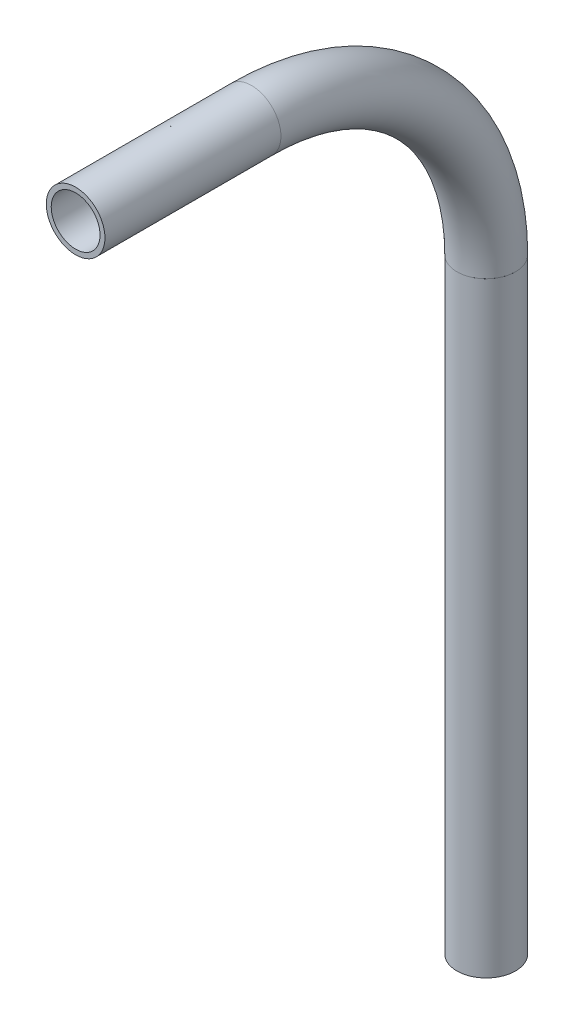
ISO-10303-21;
HEADER;
FILE_DESCRIPTION(('STEP AP214'),'2;1');
FILE_NAME('part.step','',(''),(''),'','','');
FILE_SCHEMA(('AUTOMOTIVE_DESIGN { 1 0 10303 214 1 1 1 1 }'));
ENDSEC;
DATA;
#1=APPLICATION_CONTEXT('core data for automotive mechanical design processes');
#2=APPLICATION_PROTOCOL_DEFINITION('international standard','automotive_design',2000,#1);
#3=PRODUCT_CONTEXT('',#1,'mechanical');
#4=PRODUCT('Part','Part','',(#3));
#5=PRODUCT_RELATED_PRODUCT_CATEGORY('part','',(#4));
#6=PRODUCT_DEFINITION_FORMATION('','',#4);
#7=PRODUCT_DEFINITION_CONTEXT('part definition',#1,'design');
#8=PRODUCT_DEFINITION('design','',#6,#7);
#9=PRODUCT_DEFINITION_SHAPE('','',#8);
#10=(LENGTH_UNIT() NAMED_UNIT(*) SI_UNIT(.MILLI.,.METRE.));
#11=(NAMED_UNIT(*) PLANE_ANGLE_UNIT() SI_UNIT($,.RADIAN.));
#12=(NAMED_UNIT(*) SI_UNIT($,.STERADIAN.) SOLID_ANGLE_UNIT());
#13=UNCERTAINTY_MEASURE_WITH_UNIT(LENGTH_MEASURE(1.E-05),#10,'distance_accuracy_value','');
#14=(GEOMETRIC_REPRESENTATION_CONTEXT(3) GLOBAL_UNCERTAINTY_ASSIGNED_CONTEXT((#13)) GLOBAL_UNIT_ASSIGNED_CONTEXT((#10,
#11,#12)) REPRESENTATION_CONTEXT('',''));
#15=CARTESIAN_POINT('',(0.,0.,0.));
#16=DIRECTION('',(0.,0.,1.));
#17=DIRECTION('',(1.,0.,0.));
#18=AXIS2_PLACEMENT_3D('',#15,#16,#17);
#19=CARTESIAN_POINT('',(0.,1154.01983603827,296.580509382977));
#20=DIRECTION('',(0.,-1.,0.));
#21=DIRECTION('',(0.,0.,-1.));
#22=AXIS2_PLACEMENT_3D('',#19,#20,#21);
#23=CYLINDRICAL_SURFACE('',#22,5.28319999999999);
#24=CARTESIAN_POINT('',(0.,1022.91902111895,296.580509382977));
#25=DIRECTION('',(0.,1.,0.));
#26=DIRECTION('',(0.,0.,1.));
#27=AXIS2_PLACEMENT_3D('',#24,#25,#26);
#28=CIRCLE('',#27,5.28319999999999);
#29=CARTESIAN_POINT('',(0.,1022.91902111895,301.863709382977));
#30=VERTEX_POINT('',#29);
#31=EDGE_CURVE('E50',#30,#30,#28,.T.);
#32=ORIENTED_EDGE('',*,*,#31,.F.);
#33=EDGE_LOOP('',(#32));
#34=FACE_BOUND('',#33,.T.);
#35=CARTESIAN_POINT('',(0.,1154.01983603827,296.580509382977));
#36=DIRECTION('',(0.,1.,0.));
#37=DIRECTION('',(0.,0.,1.));
#38=AXIS2_PLACEMENT_3D('',#35,#36,#37);
#39=CIRCLE('',#38,5.28319999999999);
#40=CARTESIAN_POINT('',(0.,1154.01983603827,301.863709382977));
#41=VERTEX_POINT('',#40);
#42=EDGE_CURVE('E46',#41,#41,#39,.T.);
#43=ORIENTED_EDGE('',*,*,#42,.T.);
#44=EDGE_LOOP('',(#43));
#45=FACE_BOUND('',#44,.T.);
#46=ADVANCED_FACE('F42',(#34,#45),#23,.F.);
#47=CARTESIAN_POINT('',(0.,1154.01983603827,296.580509382977));
#48=DIRECTION('',(0.,-1.,0.));
#49=DIRECTION('',(0.,0.,-1.));
#50=AXIS2_PLACEMENT_3D('',#47,#48,#49);
#51=CYLINDRICAL_SURFACE('',#50,6.35);
#52=CARTESIAN_POINT('',(0.,1022.91902111895,296.580509382977));
#53=DIRECTION('',(0.,1.,0.));
#54=DIRECTION('',(0.,0.,1.));
#55=AXIS2_PLACEMENT_3D('',#52,#53,#54);
#56=CIRCLE('',#55,6.35);
#57=CARTESIAN_POINT('',(0.,1022.91902111895,302.930509382977));
#58=VERTEX_POINT('',#57);
#59=EDGE_CURVE('E54',#58,#58,#56,.T.);
#60=ORIENTED_EDGE('',*,*,#59,.T.);
#61=EDGE_LOOP('',(#60));
#62=FACE_BOUND('',#61,.T.);
#63=CARTESIAN_POINT('',(0.,1154.01983603827,296.580509382977));
#64=DIRECTION('',(0.,1.,0.));
#65=DIRECTION('',(0.,0.,1.));
#66=AXIS2_PLACEMENT_3D('',#63,#64,#65);
#67=CIRCLE('',#66,6.35);
#68=CARTESIAN_POINT('',(0.,1154.01983603827,302.930509382977));
#69=VERTEX_POINT('',#68);
#70=EDGE_CURVE('E12',#69,#69,#67,.T.);
#71=ORIENTED_EDGE('',*,*,#70,.F.);
#72=EDGE_LOOP('',(#71));
#73=FACE_BOUND('',#72,.T.);
#74=ADVANCED_FACE('F69',(#62,#73),#51,.T.);
#75=CARTESIAN_POINT('',(0.,1022.91902111895,296.580509382977));
#76=DIRECTION('',(0.,1.,0.));
#77=DIRECTION('',(0.,0.,1.));
#78=AXIS2_PLACEMENT_3D('',#75,#76,#77);
#79=PLANE('',#78);
#80=ORIENTED_EDGE('',*,*,#31,.T.);
#81=EDGE_LOOP('',(#80));
#82=FACE_BOUND('',#81,.T.);
#83=ORIENTED_EDGE('',*,*,#59,.F.);
#84=EDGE_LOOP('',(#83));
#85=FACE_BOUND('',#84,.T.);
#86=ADVANCED_FACE('F65',(#82,#85),#79,.F.);
#87=CARTESIAN_POINT('',(0.,1154.01983603827,296.580509382977));
#88=DIRECTION('',(0.,1.,0.));
#89=DIRECTION('',(0.,0.,1.));
#90=AXIS2_PLACEMENT_3D('',#87,#88,#89);
#91=PLANE('',#90);
#92=ORIENTED_EDGE('',*,*,#42,.F.);
#93=EDGE_LOOP('',(#92));
#94=FACE_BOUND('',#93,.T.);
#95=ORIENTED_EDGE('',*,*,#70,.T.);
#96=EDGE_LOOP('',(#95));
#97=FACE_BOUND('',#96,.T.);
#98=ADVANCED_FACE('F44',(#94,#97),#91,.T.);
#99=CLOSED_SHELL('',(#46,#74,#86,#98));
#100=MANIFOLD_SOLID_BREP('B2',#99);
#101=CARTESIAN_POINT('',(0.,1154.01983603827,347.380509382977));
#102=DIRECTION('',(-1.,0.,0.));
#103=DIRECTION('',(0.,0.,1.));
#104=AXIS2_PLACEMENT_3D('',#101,#102,#103);
#105=TOROIDAL_SURFACE('',#104,50.7999999999997,5.28319999999999);
#106=CARTESIAN_POINT('',(0.,1204.81983603827,347.380509382977));
#107=DIRECTION('',(0.,0.,1.));
#108=DIRECTION('',(0.,-1.,0.));
#109=AXIS2_PLACEMENT_3D('',#106,#107,#108);
#110=CIRCLE('',#109,5.28319999999999);
#111=CARTESIAN_POINT('',(0.,1210.10303603827,347.380509382977));
#112=VERTEX_POINT('',#111);
#113=EDGE_CURVE('E135',#112,#112,#110,.T.);
#114=CARTESIAN_POINT('',(0.,1154.01983603827,296.580509382977));
#115=DIRECTION('',(0.,-1.,0.));
#116=DIRECTION('',(0.,0.,-1.));
#117=AXIS2_PLACEMENT_3D('',#114,#115,#116);
#118=CIRCLE('',#117,5.28319999999999);
#119=CARTESIAN_POINT('',(0.,1154.01983603827,291.297309382977));
#120=VERTEX_POINT('',#119);
#121=EDGE_CURVE('E125',#120,#120,#118,.T.);
#122=CARTESIAN_POINT('',(0.,1154.01983603827,347.380509382977));
#123=DIRECTION('',(-1.,0.,0.));
#124=DIRECTION('',(0.,0.,1.));
#125=AXIS2_PLACEMENT_3D('',#122,#123,#124);
#126=CIRCLE('',#125,56.0831999999997);
#127=EDGE_CURVE('',#112,#120,#126,.T.);
#128=ORIENTED_EDGE('',*,*,#113,.T.);
#129=ORIENTED_EDGE('',*,*,#121,.T.);
#130=ORIENTED_EDGE('',*,*,#127,.T.);
#131=ORIENTED_EDGE('',*,*,#127,.F.);
#132=EDGE_LOOP('',(#128,#130,#129,#131));
#133=FACE_BOUND('',#132,.T.);
#134=ADVANCED_FACE('F121',(#133),#105,.F.);
#135=CARTESIAN_POINT('',(0.,1154.01983603827,347.380509382977));
#136=DIRECTION('',(-1.,0.,0.));
#137=DIRECTION('',(0.,0.,1.));
#138=AXIS2_PLACEMENT_3D('',#135,#136,#137);
#139=TOROIDAL_SURFACE('',#138,50.7999999999997,6.35);
#140=CARTESIAN_POINT('',(0.,1204.81983603827,347.380509382977));
#141=DIRECTION('',(0.,0.,1.));
#142=DIRECTION('',(0.,-1.,0.));
#143=AXIS2_PLACEMENT_3D('',#140,#141,#142);
#144=CIRCLE('',#143,6.35);
#145=CARTESIAN_POINT('',(0.,1211.16983603827,347.380509382977));
#146=VERTEX_POINT('',#145);
#147=EDGE_CURVE('E129',#146,#146,#144,.T.);
#148=CARTESIAN_POINT('',(0.,1154.01983603827,296.580509382977));
#149=DIRECTION('',(0.,-1.,0.));
#150=DIRECTION('',(0.,0.,-1.));
#151=AXIS2_PLACEMENT_3D('',#148,#149,#150);
#152=CIRCLE('',#151,6.35);
#153=CARTESIAN_POINT('',(0.,1154.01983603827,290.230509382977));
#154=VERTEX_POINT('',#153);
#155=EDGE_CURVE('E41',#154,#154,#152,.T.);
#156=CARTESIAN_POINT('',(0.,1154.01983603827,347.380509382977));
#157=DIRECTION('',(-1.,0.,0.));
#158=DIRECTION('',(0.,0.,1.));
#159=AXIS2_PLACEMENT_3D('',#156,#157,#158);
#160=CIRCLE('',#159,57.1499999999997);
#161=EDGE_CURVE('',#146,#154,#160,.T.);
#162=ORIENTED_EDGE('',*,*,#147,.F.);
#163=ORIENTED_EDGE('',*,*,#155,.F.);
#164=ORIENTED_EDGE('',*,*,#161,.T.);
#165=ORIENTED_EDGE('',*,*,#161,.F.);
#166=EDGE_LOOP('',(#162,#164,#163,#165));
#167=FACE_BOUND('',#166,.T.);
#168=ADVANCED_FACE('F148',(#167),#139,.T.);
#169=CARTESIAN_POINT('',(0.,1204.81983603827,347.380509382977));
#170=DIRECTION('',(0.,0.,1.));
#171=DIRECTION('',(0.,-1.,0.));
#172=AXIS2_PLACEMENT_3D('',#169,#170,#171);
#173=PLANE('',#172);
#174=ORIENTED_EDGE('',*,*,#113,.F.);
#175=EDGE_LOOP('',(#174));
#176=FACE_BOUND('',#175,.T.);
#177=ORIENTED_EDGE('',*,*,#147,.T.);
#178=EDGE_LOOP('',(#177));
#179=FACE_BOUND('',#178,.T.);
#180=ADVANCED_FACE('F144',(#176,#179),#173,.T.);
#181=CARTESIAN_POINT('',(0.,1154.01983603827,296.580509382977));
#182=DIRECTION('',(0.,-1.,0.));
#183=DIRECTION('',(0.,0.,-1.));
#184=AXIS2_PLACEMENT_3D('',#181,#182,#183);
#185=PLANE('',#184);
#186=ORIENTED_EDGE('',*,*,#121,.F.);
#187=EDGE_LOOP('',(#186));
#188=FACE_BOUND('',#187,.T.);
#189=ORIENTED_EDGE('',*,*,#155,.T.);
#190=EDGE_LOOP('',(#189));
#191=FACE_BOUND('',#190,.T.);
#192=ADVANCED_FACE('F123',(#188,#191),#185,.T.);
#193=CLOSED_SHELL('',(#134,#168,#180,#192));
#194=MANIFOLD_SOLID_BREP('B7',#193);
#195=CARTESIAN_POINT('',(0.,1204.81983603827,385.480509382977));
#196=DIRECTION('',(0.,0.,-1.));
#197=DIRECTION('',(0.,1.,0.));
#198=AXIS2_PLACEMENT_3D('',#195,#196,#197);
#199=CYLINDRICAL_SURFACE('',#198,5.28319999999999);
#200=CARTESIAN_POINT('',(0.,1204.81983603827,385.480509382977));
#201=DIRECTION('',(0.,0.,1.));
#202=DIRECTION('',(0.,-1.,0.));
#203=AXIS2_PLACEMENT_3D('',#200,#201,#202);
#204=CIRCLE('',#203,5.28319999999999);
#205=CARTESIAN_POINT('',(0.,1199.53663603827,385.480509382977));
#206=VERTEX_POINT('',#205);
#207=EDGE_CURVE('E209',#206,#206,#204,.T.);
#208=ORIENTED_EDGE('',*,*,#207,.T.);
#209=EDGE_LOOP('',(#208));
#210=FACE_BOUND('',#209,.T.);
#211=CARTESIAN_POINT('',(0.,1204.81983603827,347.380509382977));
#212=DIRECTION('',(0.,0.,-1.));
#213=DIRECTION('',(0.,1.,0.));
#214=AXIS2_PLACEMENT_3D('',#211,#212,#213);
#215=CIRCLE('',#214,5.28319999999999);
#216=CARTESIAN_POINT('',(0.,1210.10303603827,347.380509382977));
#217=VERTEX_POINT('',#216);
#218=EDGE_CURVE('E199',#217,#217,#215,.T.);
#219=ORIENTED_EDGE('',*,*,#218,.T.);
#220=EDGE_LOOP('',(#219));
#221=FACE_BOUND('',#220,.T.);
#222=ADVANCED_FACE('F195',(#210,#221),#199,.F.);
#223=CARTESIAN_POINT('',(0.,1204.81983603827,385.480509382977));
#224=DIRECTION('',(0.,0.,-1.));
#225=DIRECTION('',(0.,1.,0.));
#226=AXIS2_PLACEMENT_3D('',#223,#224,#225);
#227=CYLINDRICAL_SURFACE('',#226,6.35);
#228=CARTESIAN_POINT('',(0.,1204.81983603827,385.480509382977));
#229=DIRECTION('',(0.,0.,1.));
#230=DIRECTION('',(0.,-1.,0.));
#231=AXIS2_PLACEMENT_3D('',#228,#229,#230);
#232=CIRCLE('',#231,6.35);
#233=CARTESIAN_POINT('',(0.,1198.46983603827,385.480509382977));
#234=VERTEX_POINT('',#233);
#235=EDGE_CURVE('E203',#234,#234,#232,.T.);
#236=ORIENTED_EDGE('',*,*,#235,.F.);
#237=EDGE_LOOP('',(#236));
#238=FACE_BOUND('',#237,.T.);
#239=CARTESIAN_POINT('',(0.,1204.81983603827,347.380509382977));
#240=DIRECTION('',(0.,0.,-1.));
#241=DIRECTION('',(0.,1.,0.));
#242=AXIS2_PLACEMENT_3D('',#239,#240,#241);
#243=CIRCLE('',#242,6.35);
#244=CARTESIAN_POINT('',(0.,1211.16983603827,347.380509382977));
#245=VERTEX_POINT('',#244);
#246=EDGE_CURVE('E120',#245,#245,#243,.T.);
#247=ORIENTED_EDGE('',*,*,#246,.F.);
#248=EDGE_LOOP('',(#247));
#249=FACE_BOUND('',#248,.T.);
#250=ADVANCED_FACE('F222',(#238,#249),#227,.T.);
#251=CARTESIAN_POINT('',(0.,1204.81983603827,385.480509382977));
#252=DIRECTION('',(0.,0.,1.));
#253=DIRECTION('',(0.,-1.,0.));
#254=AXIS2_PLACEMENT_3D('',#251,#252,#253);
#255=PLANE('',#254);
#256=ORIENTED_EDGE('',*,*,#207,.F.);
#257=EDGE_LOOP('',(#256));
#258=FACE_BOUND('',#257,.T.);
#259=ORIENTED_EDGE('',*,*,#235,.T.);
#260=EDGE_LOOP('',(#259));
#261=FACE_BOUND('',#260,.T.);
#262=ADVANCED_FACE('F218',(#258,#261),#255,.T.);
#263=CARTESIAN_POINT('',(0.,1204.81983603827,347.380509382977));
#264=DIRECTION('',(0.,0.,-1.));
#265=DIRECTION('',(0.,1.,0.));
#266=AXIS2_PLACEMENT_3D('',#263,#264,#265);
#267=PLANE('',#266);
#268=ORIENTED_EDGE('',*,*,#218,.F.);
#269=EDGE_LOOP('',(#268));
#270=FACE_BOUND('',#269,.T.);
#271=ORIENTED_EDGE('',*,*,#246,.T.);
#272=EDGE_LOOP('',(#271));
#273=FACE_BOUND('',#272,.T.);
#274=ADVANCED_FACE('F197',(#270,#273),#267,.T.);
#275=CLOSED_SHELL('',(#222,#250,#262,#274));
#276=MANIFOLD_SOLID_BREP('B36',#275);
#277=ADVANCED_BREP_SHAPE_REPRESENTATION('',(#18,#100,#194,#276),#14);
#278=SHAPE_DEFINITION_REPRESENTATION(#9,#277);
ENDSEC;
END-ISO-10303-21;
